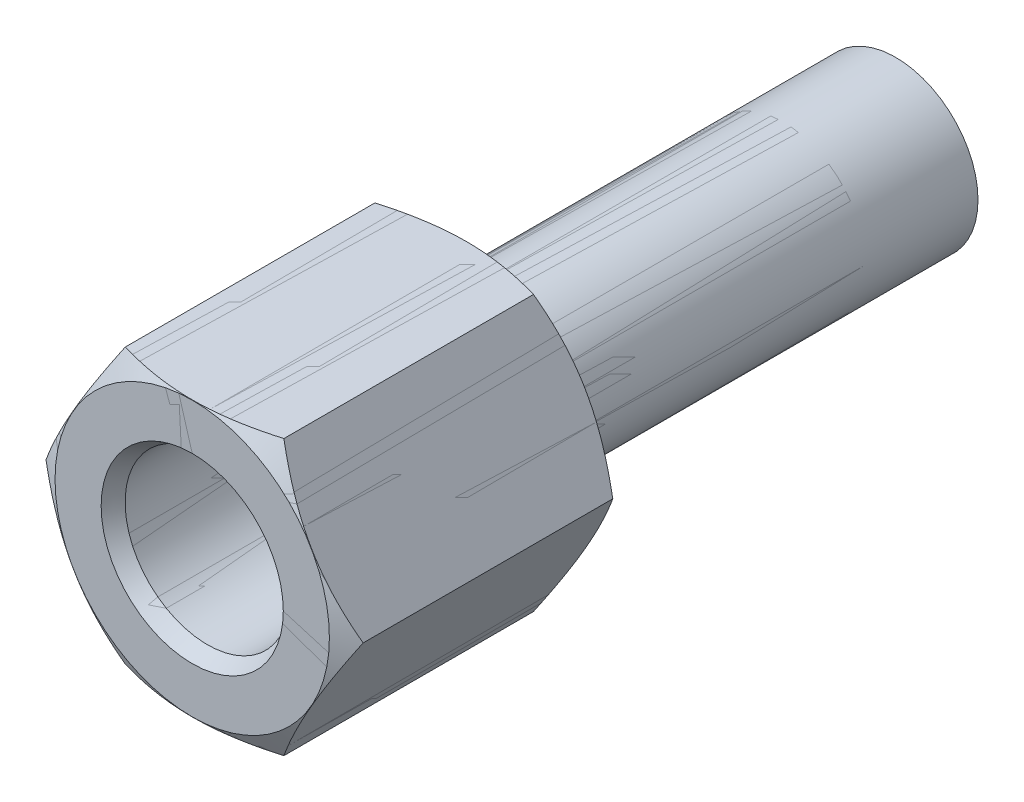
ISO-10303-21;
HEADER;
FILE_DESCRIPTION(('STEP AP214'),'2;1');
FILE_NAME('part.step','',(''),(''),'','','');
FILE_SCHEMA(('AUTOMOTIVE_DESIGN { 1 0 10303 214 1 1 1 1 }'));
ENDSEC;
DATA;
#1=APPLICATION_CONTEXT('core data for automotive mechanical design processes');
#2=APPLICATION_PROTOCOL_DEFINITION('international standard','automotive_design',2000,#1);
#3=PRODUCT_CONTEXT('',#1,'mechanical');
#4=PRODUCT('Part','Part','',(#3));
#5=PRODUCT_RELATED_PRODUCT_CATEGORY('part','',(#4));
#6=PRODUCT_DEFINITION_FORMATION('','',#4);
#7=PRODUCT_DEFINITION_CONTEXT('part definition',#1,'design');
#8=PRODUCT_DEFINITION('design','',#6,#7);
#9=PRODUCT_DEFINITION_SHAPE('','',#8);
#10=(LENGTH_UNIT() NAMED_UNIT(*) SI_UNIT(.MILLI.,.METRE.));
#11=(NAMED_UNIT(*) PLANE_ANGLE_UNIT() SI_UNIT($,.RADIAN.));
#12=(NAMED_UNIT(*) SI_UNIT($,.STERADIAN.) SOLID_ANGLE_UNIT());
#13=UNCERTAINTY_MEASURE_WITH_UNIT(LENGTH_MEASURE(1.E-05),#10,'distance_accuracy_value','');
#14=(GEOMETRIC_REPRESENTATION_CONTEXT(3) GLOBAL_UNCERTAINTY_ASSIGNED_CONTEXT((#13)) GLOBAL_UNIT_ASSIGNED_CONTEXT((#10,
#11,#12)) REPRESENTATION_CONTEXT('',''));
#15=CARTESIAN_POINT('',(0.,0.,0.));
#16=DIRECTION('',(0.,0.,1.));
#17=DIRECTION('',(1.,0.,0.));
#18=AXIS2_PLACEMENT_3D('',#15,#16,#17);
#19=CARTESIAN_POINT('',(0.,0.,2.));
#20=DIRECTION('',(0.,0.,1.));
#21=DIRECTION('',(1.,0.,0.));
#22=AXIS2_PLACEMENT_3D('',#19,#20,#21);
#23=CONICAL_SURFACE('',#22,1.5,1.047197551197);
#24=CARTESIAN_POINT('',(0.,0.,2.));
#25=DIRECTION('',(0.,0.,1.));
#26=DIRECTION('',(1.,0.,0.));
#27=AXIS2_PLACEMENT_3D('',#24,#25,#26);
#28=CIRCLE('',#27,1.5);
#29=CARTESIAN_POINT('',(1.5,0.,2.));
#30=VERTEX_POINT('',#29);
#31=EDGE_CURVE('P0_E46',#30,#30,#28,.T.);
#32=ORIENTED_EDGE('',*,*,#31,.T.);
#33=DIRECTION('',(-0.866025403784329,0.,-0.50000000000019));
#34=VECTOR('',#33,1.);
#35=CARTESIAN_POINT('',(1.5,0.,2.));
#36=LINE('',#35,#34);
#37=CARTESIAN_POINT('',(0.,0.,1.133974596216));
#38=VERTEX_POINT('',#37);
#39=EDGE_CURVE('P0_E11',#30,#38,#36,.T.);
#40=ORIENTED_EDGE('',*,*,#39,.T.);
#41=ORIENTED_EDGE('',*,*,#39,.F.);
#42=EDGE_LOOP('',(#32,#40,#41));
#43=FACE_BOUND('',#42,.T.);
#44=ADVANCED_FACE('P0_F37',(#43),#23,.F.);
#45=CARTESIAN_POINT('',(0.,0.,4.722871870789));
#46=DIRECTION('',(0.,0.,-1.));
#47=DIRECTION('',(1.,0.,0.));
#48=AXIS2_PLACEMENT_3D('',#45,#46,#47);
#49=CYLINDRICAL_SURFACE('',#48,1.5);
#50=CARTESIAN_POINT('',(0.,0.,4.722871870789));
#51=DIRECTION('',(0.,0.,1.));
#52=DIRECTION('',(1.,0.,0.));
#53=AXIS2_PLACEMENT_3D('',#50,#51,#52);
#54=CIRCLE('',#53,1.5);
#55=CARTESIAN_POINT('',(1.5,0.,4.722871870789));
#56=VERTEX_POINT('',#55);
#57=EDGE_CURVE('P0_E180',#56,#56,#54,.T.);
#58=ORIENTED_EDGE('',*,*,#57,.T.);
#59=DIRECTION('',(0.,0.,-1.));
#60=VECTOR('',#59,1.);
#61=CARTESIAN_POINT('',(1.5,0.,4.722871870789));
#62=LINE('',#61,#60);
#63=EDGE_CURVE('P0_E182',#56,#30,#62,.T.);
#64=ORIENTED_EDGE('',*,*,#63,.T.);
#65=ORIENTED_EDGE('',*,*,#31,.F.);
#66=ORIENTED_EDGE('',*,*,#63,.F.);
#67=EDGE_LOOP('',(#58,#64,#65,#66));
#68=FACE_BOUND('',#67,.T.);
#69=ADVANCED_FACE('P0_F39',(#68),#49,.F.);
#70=CARTESIAN_POINT('',(0.,0.,5.));
#71=DIRECTION('',(0.,0.,1.));
#72=DIRECTION('',(1.,0.,0.));
#73=AXIS2_PLACEMENT_3D('',#70,#71,#72);
#74=CONICAL_SURFACE('',#73,1.66,0.523598775598);
#75=CARTESIAN_POINT('',(0.,0.,5.));
#76=DIRECTION('',(0.,0.,1.));
#77=DIRECTION('',(1.,0.,0.));
#78=AXIS2_PLACEMENT_3D('',#75,#76,#77);
#79=CIRCLE('',#78,1.66);
#80=CARTESIAN_POINT('',(1.66,0.,5.));
#81=VERTEX_POINT('',#80);
#82=EDGE_CURVE('P0_E152',#81,#81,#79,.T.);
#83=ORIENTED_EDGE('',*,*,#82,.T.);
#84=DIRECTION('',(-0.50000000000019,0.,-0.866025403784329));
#85=VECTOR('',#84,1.);
#86=CARTESIAN_POINT('',(1.66,0.,5.));
#87=LINE('',#86,#85);
#88=EDGE_CURVE('P0_E151',#81,#56,#87,.T.);
#89=ORIENTED_EDGE('',*,*,#88,.T.);
#90=ORIENTED_EDGE('',*,*,#57,.F.);
#91=ORIENTED_EDGE('',*,*,#88,.F.);
#92=EDGE_LOOP('',(#83,#89,#90,#91));
#93=FACE_BOUND('',#92,.T.);
#94=ADVANCED_FACE('P0_F286',(#93),#74,.F.);
#95=CARTESIAN_POINT('',(0.,0.,-7.821021416551));
#96=DIRECTION('',(0.,0.,1.));
#97=DIRECTION('',(1.,0.,0.));
#98=AXIS2_PLACEMENT_3D('',#95,#96,#97);
#99=CYLINDRICAL_SURFACE('',#98,1.5);
#100=CARTESIAN_POINT('',(0.,0.,-5.774833395025));
#101=DIRECTION('',(0.,0.,1.));
#102=DIRECTION('',(1.,0.,0.));
#103=AXIS2_PLACEMENT_3D('',#100,#101,#102);
#104=CIRCLE('',#103,1.5);
#105=CARTESIAN_POINT('',(1.5,0.,-5.774833395025));
#106=VERTEX_POINT('',#105);
#107=EDGE_CURVE('P0_E41',#106,#106,#104,.F.);
#108=ORIENTED_EDGE('',*,*,#107,.F.);
#109=DIRECTION('',(0.,0.,1.));
#110=VECTOR('',#109,1.);
#111=CARTESIAN_POINT('',(1.5,0.,-7.821021416551));
#112=LINE('',#111,#110);
#113=CARTESIAN_POINT('',(1.5,0.,0.));
#114=VERTEX_POINT('',#113);
#115=EDGE_CURVE('P0_E146',#106,#114,#112,.T.);
#116=ORIENTED_EDGE('',*,*,#115,.T.);
#117=CARTESIAN_POINT('',(0.,0.,0.));
#118=DIRECTION('',(0.,0.,1.));
#119=DIRECTION('',(1.,0.,0.));
#120=AXIS2_PLACEMENT_3D('',#117,#118,#119);
#121=CIRCLE('',#120,1.5);
#122=EDGE_CURVE('P0_E120',#114,#114,#121,.T.);
#123=ORIENTED_EDGE('',*,*,#122,.F.);
#124=ORIENTED_EDGE('',*,*,#115,.F.);
#125=EDGE_LOOP('',(#108,#116,#123,#124));
#126=FACE_BOUND('',#125,.T.);
#127=ADVANCED_FACE('P0_F277',(#126),#99,.T.);
#128=CARTESIAN_POINT('',(0.,0.,5.));
#129=DIRECTION('',(0.,0.,1.));
#130=DIRECTION('',(1.,0.,0.));
#131=AXIS2_PLACEMENT_3D('',#128,#129,#130);
#132=PLANE('',#131);
#133=ORIENTED_EDGE('',*,*,#82,.F.);
#134=EDGE_LOOP('',(#133));
#135=FACE_BOUND('',#134,.T.);
#136=CARTESIAN_POINT('',(0.,0.,5.));
#137=DIRECTION('',(0.,0.,1.));
#138=DIRECTION('',(1.,0.,0.));
#139=AXIS2_PLACEMENT_3D('',#136,#137,#138);
#140=CIRCLE('',#139,2.5);
#141=CARTESIAN_POINT('',(2.5,0.,5.));
#142=VERTEX_POINT('',#141);
#143=EDGE_CURVE('P0_E199',#142,#142,#140,.T.);
#144=ORIENTED_EDGE('',*,*,#143,.T.);
#145=EDGE_LOOP('',(#144));
#146=FACE_BOUND('',#145,.T.);
#147=ADVANCED_FACE('P0_F274',(#135,#146),#132,.T.);
#148=CARTESIAN_POINT('',(0.,0.,0.));
#149=DIRECTION('',(0.,0.,1.));
#150=DIRECTION('',(1.,0.,0.));
#151=AXIS2_PLACEMENT_3D('',#148,#149,#150);
#152=PLANE('',#151);
#153=CARTESIAN_POINT('',(0.,0.,0.));
#154=DIRECTION('',(0.,0.,1.));
#155=DIRECTION('',(1.,0.,0.));
#156=AXIS2_PLACEMENT_3D('',#153,#154,#155);
#157=CIRCLE('',#156,2.5);
#158=CARTESIAN_POINT('',(2.5,0.,0.));
#159=VERTEX_POINT('',#158);
#160=EDGE_CURVE('P0_E136',#159,#159,#157,.T.);
#161=ORIENTED_EDGE('',*,*,#160,.F.);
#162=EDGE_LOOP('',(#161));
#163=FACE_BOUND('',#162,.T.);
#164=ORIENTED_EDGE('',*,*,#122,.T.);
#165=EDGE_LOOP('',(#164));
#166=FACE_BOUND('',#165,.T.);
#167=ADVANCED_FACE('P0_F276',(#163,#166),#152,.F.);
#168=CARTESIAN_POINT('',(-1.445,-2.502813416937,-10.));
#169=DIRECTION('',(0.,1.,0.));
#170=DIRECTION('',(1.,0.,0.));
#171=AXIS2_PLACEMENT_3D('',#168,#169,#170);
#172=PLANE('',#171);
#173=DIRECTION('',(0.,0.,1.));
#174=VECTOR('',#173,1.);
#175=CARTESIAN_POINT('',(1.445,-2.502813416937,-10.));
#176=LINE('',#175,#174);
#177=CARTESIAN_POINT('',(1.445,-2.502813416937,0.225166604975));
#178=VERTEX_POINT('',#177);
#179=CARTESIAN_POINT('',(1.445,-2.502813416937,4.774833395016));
#180=VERTEX_POINT('',#179);
#181=EDGE_CURVE('P0_E192',#178,#180,#176,.T.);
#182=ORIENTED_EDGE('',*,*,#181,.T.);
#183=CARTESIAN_POINT('',(1.44500000000008,-2.502813416937,4.77483339501595));
#184=CARTESIAN_POINT('',(0.,-2.50281341693702,5.1919689645055));
#185=CARTESIAN_POINT('',(-1.44499999999997,-2.502813416937,4.77483339501598));
#186=(BOUNDED_CURVE() B_SPLINE_CURVE(2,(#183,#184,#185),.UNSPECIFIED.,.F.,
.F.) B_SPLINE_CURVE_WITH_KNOTS((3,3),(0.,1.),
.UNSPECIFIED.) CURVE() GEOMETRIC_REPRESENTATION_ITEM() RATIONAL_B_SPLINE_CURVE((1.,
1.15470053837926,1.)) REPRESENTATION_ITEM(''));
#187=CARTESIAN_POINT('',(-1.445,-2.502813416937,4.774833395016));
#188=VERTEX_POINT('',#187);
#189=EDGE_CURVE('P0_E116',#180,#188,#186,.T.);
#190=ORIENTED_EDGE('',*,*,#189,.T.);
#191=DIRECTION('',(0.,0.,1.));
#192=VECTOR('',#191,1.);
#193=CARTESIAN_POINT('',(-1.445,-2.502813416937,-10.));
#194=LINE('',#193,#192);
#195=CARTESIAN_POINT('',(-1.445,-2.502813416937,0.225166604975));
#196=VERTEX_POINT('',#195);
#197=EDGE_CURVE('P0_E109',#196,#188,#194,.T.);
#198=ORIENTED_EDGE('',*,*,#197,.F.);
#199=CARTESIAN_POINT('',(-1.44500000000178,-2.502813416937,0.225166604976029));
#200=CARTESIAN_POINT('',(-8.90842954959227E-13,-2.502813416937,-0.19196896449825));
#201=CARTESIAN_POINT('',(1.44499999999941,-2.502813416937,0.225166604975343));
#202=(BOUNDED_CURVE() B_SPLINE_CURVE(2,(#199,#200,#201),.UNSPECIFIED.,.F.,
.F.) B_SPLINE_CURVE_WITH_KNOTS((3,3),(0.,1.),
.UNSPECIFIED.) CURVE() GEOMETRIC_REPRESENTATION_ITEM() RATIONAL_B_SPLINE_CURVE((1.,
1.15470053837937,1.)) REPRESENTATION_ITEM(''));
#203=EDGE_CURVE('P0_E113',#196,#178,#202,.T.);
#204=ORIENTED_EDGE('',*,*,#203,.T.);
#205=EDGE_LOOP('',(#182,#190,#198,#204));
#206=FACE_BOUND('',#205,.T.);
#207=ADVANCED_FACE('P0_F111',(#206),#172,.F.);
#208=CARTESIAN_POINT('',(-2.89,0.,-10.));
#209=DIRECTION('',(0.866025403784329,0.50000000000019,0.));
#210=DIRECTION('',(0.,0.,-1.));
#211=AXIS2_PLACEMENT_3D('',#208,#209,#210);
#212=PLANE('',#211);
#213=ORIENTED_EDGE('',*,*,#197,.T.);
#214=CARTESIAN_POINT('',(-1.44499999999986,-2.50281341693713,4.77483339501589));
#215=CARTESIAN_POINT('',(-2.16750000000006,-1.25140670846891,5.19196896450558));
#216=CARTESIAN_POINT('',(-2.89000000000029,-6.22391027604863E-13,4.77483339501581));
#217=(BOUNDED_CURVE() B_SPLINE_CURVE(2,(#214,#215,#216),.UNSPECIFIED.,.F.,
.F.) B_SPLINE_CURVE_WITH_KNOTS((3,3),(0.,1.),
.UNSPECIFIED.) CURVE() GEOMETRIC_REPRESENTATION_ITEM() RATIONAL_B_SPLINE_CURVE((1.,
1.15470053837934,1.)) REPRESENTATION_ITEM(''));
#218=CARTESIAN_POINT('',(-2.89,0.,4.774833395016));
#219=VERTEX_POINT('',#218);
#220=EDGE_CURVE('P0_E211',#188,#219,#217,.T.);
#221=ORIENTED_EDGE('',*,*,#220,.T.);
#222=DIRECTION('',(0.,0.,1.));
#223=VECTOR('',#222,1.);
#224=CARTESIAN_POINT('',(-2.89,0.,-10.));
#225=LINE('',#224,#223);
#226=CARTESIAN_POINT('',(-2.89,0.,0.225166604975));
#227=VERTEX_POINT('',#226);
#228=EDGE_CURVE('P0_E121',#227,#219,#225,.T.);
#229=ORIENTED_EDGE('',*,*,#228,.F.);
#230=CARTESIAN_POINT('',(-2.89000000000179,1.98396854500515E-12,0.22516660497655));
#231=CARTESIAN_POINT('',(-2.16750000000077,-1.25140670846767,-0.191968964498452));
#232=CARTESIAN_POINT('',(-1.44500000000026,-2.50281341693643,0.225166604975364));
#233=(BOUNDED_CURVE() B_SPLINE_CURVE(2,(#230,#231,#232),.UNSPECIFIED.,.F.,
.F.) B_SPLINE_CURVE_WITH_KNOTS((3,3),(0.,1.),
.UNSPECIFIED.) CURVE() GEOMETRIC_REPRESENTATION_ITEM() RATIONAL_B_SPLINE_CURVE((1.,
1.15470053837956,1.)) REPRESENTATION_ITEM(''));
#234=EDGE_CURVE('P0_E124',#227,#196,#233,.T.);
#235=ORIENTED_EDGE('',*,*,#234,.T.);
#236=EDGE_LOOP('',(#213,#221,#229,#235));
#237=FACE_BOUND('',#236,.T.);
#238=ADVANCED_FACE('P0_F125',(#237),#212,.F.);
#239=CARTESIAN_POINT('',(-1.445,2.502813416937,-10.));
#240=DIRECTION('',(0.866025403784329,-0.50000000000019,0.));
#241=DIRECTION('',(0.,0.,-1.));
#242=AXIS2_PLACEMENT_3D('',#239,#240,#241);
#243=PLANE('',#242);
#244=ORIENTED_EDGE('',*,*,#228,.T.);
#245=CARTESIAN_POINT('',(-2.89000000000108,-7.4718009557273E-13,4.77483339501536));
#246=CARTESIAN_POINT('',(-2.1675000000004,1.25140670846831,5.19196896450573));
#247=CARTESIAN_POINT('',(-1.44499999999998,2.50281341693692,4.77483339501596));
#248=(BOUNDED_CURVE() B_SPLINE_CURVE(2,(#245,#246,#247),.UNSPECIFIED.,.F.,
.F.) B_SPLINE_CURVE_WITH_KNOTS((3,3),(0.,1.),
.UNSPECIFIED.) CURVE() GEOMETRIC_REPRESENTATION_ITEM() RATIONAL_B_SPLINE_CURVE((1.,
1.15470053837947,1.)) REPRESENTATION_ITEM(''));
#249=CARTESIAN_POINT('',(-1.445,2.502813416937,4.774833395016));
#250=VERTEX_POINT('',#249);
#251=EDGE_CURVE('P0_E207',#219,#250,#248,.T.);
#252=ORIENTED_EDGE('',*,*,#251,.T.);
#253=DIRECTION('',(0.,0.,1.));
#254=VECTOR('',#253,1.);
#255=CARTESIAN_POINT('',(-1.445,2.502813416937,-10.));
#256=LINE('',#255,#254);
#257=CARTESIAN_POINT('',(-1.445,2.502813416937,0.225166604975));
#258=VERTEX_POINT('',#257);
#259=EDGE_CURVE('P0_E157',#258,#250,#256,.T.);
#260=ORIENTED_EDGE('',*,*,#259,.F.);
#261=CARTESIAN_POINT('',(-1.444999999999,2.50281341693861,0.22516660497609));
#262=CARTESIAN_POINT('',(-2.16749999999965,1.25140670846962,-0.191968964498347));
#263=CARTESIAN_POINT('',(-2.89000000000005,1.03450581434572E-12,0.225166604975544));
#264=(BOUNDED_CURVE() B_SPLINE_CURVE(2,(#261,#262,#263),.UNSPECIFIED.,.F.,
.F.) B_SPLINE_CURVE_WITH_KNOTS((3,3),(0.,1.),
.UNSPECIFIED.) CURVE() GEOMETRIC_REPRESENTATION_ITEM() RATIONAL_B_SPLINE_CURVE((1.,
1.15470053837947,1.)) REPRESENTATION_ITEM(''));
#265=EDGE_CURVE('P0_E129',#258,#227,#264,.T.);
#266=ORIENTED_EDGE('',*,*,#265,.T.);
#267=EDGE_LOOP('',(#244,#252,#260,#266));
#268=FACE_BOUND('',#267,.T.);
#269=ADVANCED_FACE('P0_F254',(#268),#243,.F.);
#270=CARTESIAN_POINT('',(1.445,-2.502813416937,-10.));
#271=DIRECTION('',(-0.866025403784329,0.50000000000019,0.));
#272=DIRECTION('',(0.,0.,1.));
#273=AXIS2_PLACEMENT_3D('',#270,#271,#272);
#274=PLANE('',#273);
#275=DIRECTION('',(0.,0.,1.));
#276=VECTOR('',#275,1.);
#277=CARTESIAN_POINT('',(2.89,0.,0.225166604975));
#278=LINE('',#277,#276);
#279=CARTESIAN_POINT('',(2.89,0.,0.225166604975));
#280=VERTEX_POINT('',#279);
#281=CARTESIAN_POINT('',(2.89,0.,4.774833395016));
#282=VERTEX_POINT('',#281);
#283=EDGE_CURVE('P0_E170',#280,#282,#278,.T.);
#284=ORIENTED_EDGE('',*,*,#283,.T.);
#285=CARTESIAN_POINT('',(2.89000000000101,6.29496454962464E-13,4.77483339501539));
#286=CARTESIAN_POINT('',(2.16750000000037,-1.25140670846836,5.19196896450572));
#287=CARTESIAN_POINT('',(1.44499999999998,-2.50281341693692,4.77483339501596));
#288=(BOUNDED_CURVE() B_SPLINE_CURVE(2,(#285,#286,#287),.UNSPECIFIED.,.F.,
.F.) B_SPLINE_CURVE_WITH_KNOTS((3,3),(0.,1.),
.UNSPECIFIED.) CURVE() GEOMETRIC_REPRESENTATION_ITEM() RATIONAL_B_SPLINE_CURVE((1.,
1.15470053837946,1.)) REPRESENTATION_ITEM(''));
#289=EDGE_CURVE('P0_E142',#282,#180,#288,.T.);
#290=ORIENTED_EDGE('',*,*,#289,.T.);
#291=ORIENTED_EDGE('',*,*,#181,.F.);
#292=CARTESIAN_POINT('',(1.444999999999,-2.50281341693861,0.22516660497609));
#293=CARTESIAN_POINT('',(2.16749999999964,-1.25140670846963,-0.191968964498342));
#294=CARTESIAN_POINT('',(2.89,-1.07447384323223E-12,0.22516660497553));
#295=(BOUNDED_CURVE() B_SPLINE_CURVE(2,(#292,#293,#294),.UNSPECIFIED.,.F.,
.F.) B_SPLINE_CURVE_WITH_KNOTS((3,3),(0.,1.),
.UNSPECIFIED.) CURVE() GEOMETRIC_REPRESENTATION_ITEM() RATIONAL_B_SPLINE_CURVE((1.,
1.15470053837946,1.)) REPRESENTATION_ITEM(''));
#296=EDGE_CURVE('P0_E134',#178,#280,#295,.T.);
#297=ORIENTED_EDGE('',*,*,#296,.T.);
#298=EDGE_LOOP('',(#284,#290,#291,#297));
#299=FACE_BOUND('',#298,.T.);
#300=ADVANCED_FACE('P0_F271',(#299),#274,.F.);
#301=CARTESIAN_POINT('',(0.,0.,4.774833395016));
#302=DIRECTION('',(0.,0.,-1.));
#303=DIRECTION('',(1.,0.,0.));
#304=AXIS2_PLACEMENT_3D('',#301,#302,#303);
#305=CONICAL_SURFACE('',#304,2.89,1.047197551197);
#306=ORIENTED_EDGE('',*,*,#289,.F.);
#307=DIRECTION('',(-0.866025403784329,0.,0.50000000000019));
#308=VECTOR('',#307,1.);
#309=CARTESIAN_POINT('',(2.89,0.,4.774833395016));
#310=LINE('',#309,#308);
#311=EDGE_CURVE('P0_E196',#282,#142,#310,.T.);
#312=ORIENTED_EDGE('',*,*,#311,.T.);
#313=ORIENTED_EDGE('',*,*,#143,.F.);
#314=ORIENTED_EDGE('',*,*,#311,.F.);
#315=CARTESIAN_POINT('',(1.44499999999986,2.50281341693713,4.77483339501589));
#316=CARTESIAN_POINT('',(2.16750000000006,1.25140670846889,5.19196896450558));
#317=CARTESIAN_POINT('',(2.89000000000031,5.83311177138057E-13,4.7748333950158));
#318=(BOUNDED_CURVE() B_SPLINE_CURVE(2,(#315,#316,#317),.UNSPECIFIED.,.F.,
.F.) B_SPLINE_CURVE_WITH_KNOTS((3,3),(0.,1.),
.UNSPECIFIED.) CURVE() GEOMETRIC_REPRESENTATION_ITEM() RATIONAL_B_SPLINE_CURVE((1.,
1.15470053837934,1.)) REPRESENTATION_ITEM(''));
#319=CARTESIAN_POINT('',(1.445,2.502813416937,4.774833395016));
#320=VERTEX_POINT('',#319);
#321=EDGE_CURVE('P0_E177',#320,#282,#318,.T.);
#322=ORIENTED_EDGE('',*,*,#321,.F.);
#323=CARTESIAN_POINT('',(-1.44500000000008,2.502813416937,4.77483339501595));
#324=CARTESIAN_POINT('',(0.,2.50281341693702,5.1919689645055));
#325=CARTESIAN_POINT('',(1.44499999999997,2.502813416937,4.77483339501598));
#326=(BOUNDED_CURVE() B_SPLINE_CURVE(2,(#323,#324,#325),.UNSPECIFIED.,.F.,
.F.) B_SPLINE_CURVE_WITH_KNOTS((3,3),(0.,1.),
.UNSPECIFIED.) CURVE() GEOMETRIC_REPRESENTATION_ITEM() RATIONAL_B_SPLINE_CURVE((1.,
1.15470053837926,1.)) REPRESENTATION_ITEM(''));
#327=EDGE_CURVE('P0_E163',#250,#320,#326,.T.);
#328=ORIENTED_EDGE('',*,*,#327,.F.);
#329=ORIENTED_EDGE('',*,*,#251,.F.);
#330=ORIENTED_EDGE('',*,*,#220,.F.);
#331=ORIENTED_EDGE('',*,*,#189,.F.);
#332=EDGE_LOOP('',(#306,#312,#313,#314,#322,#328,#329,#330,#331));
#333=FACE_BOUND('',#332,.T.);
#334=ADVANCED_FACE('P0_F259',(#333),#305,.T.);
#335=CARTESIAN_POINT('',(1.445,2.502813416937,-10.));
#336=DIRECTION('',(0.,-1.,0.));
#337=DIRECTION('',(-1.,0.,0.));
#338=AXIS2_PLACEMENT_3D('',#335,#336,#337);
#339=PLANE('',#338);
#340=ORIENTED_EDGE('',*,*,#259,.T.);
#341=ORIENTED_EDGE('',*,*,#327,.T.);
#342=DIRECTION('',(0.,0.,1.));
#343=VECTOR('',#342,1.);
#344=CARTESIAN_POINT('',(1.445,2.502813416937,-10.));
#345=LINE('',#344,#343);
#346=CARTESIAN_POINT('',(1.445,2.502813416937,0.225166604975));
#347=VERTEX_POINT('',#346);
#348=EDGE_CURVE('P0_E171',#347,#320,#345,.T.);
#349=ORIENTED_EDGE('',*,*,#348,.F.);
#350=CARTESIAN_POINT('',(1.44500000000178,2.502813416937,0.225166604976029));
#351=CARTESIAN_POINT('',(8.90398865749375E-13,2.50281341693701,-0.19196896449825));
#352=CARTESIAN_POINT('',(-1.44499999999941,2.502813416937,0.225166604975343));
#353=(BOUNDED_CURVE() B_SPLINE_CURVE(2,(#350,#351,#352),.UNSPECIFIED.,.F.,
.F.) B_SPLINE_CURVE_WITH_KNOTS((3,3),(0.,1.),
.UNSPECIFIED.) CURVE() GEOMETRIC_REPRESENTATION_ITEM() RATIONAL_B_SPLINE_CURVE((1.,
1.15470053837937,1.)) REPRESENTATION_ITEM(''));
#354=EDGE_CURVE('P0_E156',#347,#258,#353,.T.);
#355=ORIENTED_EDGE('',*,*,#354,.T.);
#356=EDGE_LOOP('',(#340,#341,#349,#355));
#357=FACE_BOUND('',#356,.T.);
#358=ADVANCED_FACE('P0_F264',(#357),#339,.F.);
#359=CARTESIAN_POINT('',(0.,0.,0.));
#360=DIRECTION('',(0.,0.,1.));
#361=DIRECTION('',(1.,0.,0.));
#362=AXIS2_PLACEMENT_3D('',#359,#360,#361);
#363=CONICAL_SURFACE('',#362,2.5,1.047197551213);
#364=DIRECTION('',(0.866025403792641,0.,0.499999999985793));
#365=VECTOR('',#364,1.);
#366=CARTESIAN_POINT('',(2.5,0.,0.));
#367=LINE('',#366,#365);
#368=EDGE_CURVE('P0_E169',#159,#280,#367,.T.);
#369=ORIENTED_EDGE('',*,*,#368,.F.);
#370=ORIENTED_EDGE('',*,*,#160,.T.);
#371=ORIENTED_EDGE('',*,*,#368,.T.);
#372=ORIENTED_EDGE('',*,*,#296,.F.);
#373=ORIENTED_EDGE('',*,*,#203,.F.);
#374=ORIENTED_EDGE('',*,*,#234,.F.);
#375=ORIENTED_EDGE('',*,*,#265,.F.);
#376=ORIENTED_EDGE('',*,*,#354,.F.);
#377=CARTESIAN_POINT('',(2.89000000000186,-2.10342854245482E-12,0.225166604976589));
#378=CARTESIAN_POINT('',(2.1675000000008,1.25140670846762,-0.191968964498467));
#379=CARTESIAN_POINT('',(1.44500000000026,2.50281341693643,0.225166604975364));
#380=(BOUNDED_CURVE() B_SPLINE_CURVE(2,(#377,#378,#379),.UNSPECIFIED.,.F.,
.F.) B_SPLINE_CURVE_WITH_KNOTS((3,3),(0.,1.),
.UNSPECIFIED.) CURVE() GEOMETRIC_REPRESENTATION_ITEM() RATIONAL_B_SPLINE_CURVE((1.,
1.15470053837958,1.)) REPRESENTATION_ITEM(''));
#381=EDGE_CURVE('P0_E164',#280,#347,#380,.T.);
#382=ORIENTED_EDGE('',*,*,#381,.F.);
#383=EDGE_LOOP('',(#369,#370,#371,#372,#373,#374,#375,#376,#382));
#384=FACE_BOUND('',#383,.T.);
#385=ADVANCED_FACE('P0_F132',(#384),#363,.T.);
#386=CARTESIAN_POINT('',(2.89,0.,-10.));
#387=DIRECTION('',(-0.866025403784329,-0.50000000000019,0.));
#388=DIRECTION('',(-0.50000000000019,0.866025403784329,0.));
#389=AXIS2_PLACEMENT_3D('',#386,#387,#388);
#390=PLANE('',#389);
#391=ORIENTED_EDGE('',*,*,#348,.T.);
#392=ORIENTED_EDGE('',*,*,#321,.T.);
#393=ORIENTED_EDGE('',*,*,#283,.F.);
#394=ORIENTED_EDGE('',*,*,#381,.T.);
#395=EDGE_LOOP('',(#391,#392,#393,#394));
#396=FACE_BOUND('',#395,.T.);
#397=ADVANCED_FACE('P0_F268',(#396),#390,.F.);
#398=CARTESIAN_POINT('',(0.,-2.50281341693861,-5.774833395025));
#399=DIRECTION('',(0.,0.,1.));
#400=DIRECTION('',(1.,0.,0.));
#401=AXIS2_PLACEMENT_3D('',#398,#399,#400);
#402=PLANE('',#401);
#403=ORIENTED_EDGE('',*,*,#107,.T.);
#404=EDGE_LOOP('',(#403));
#405=FACE_BOUND('',#404,.T.);
#406=ADVANCED_FACE('P0_F304',(#405),#402,.F.);
#407=CLOSED_SHELL('',(#44,#69,#94,#127,#147,#167,#207,#238,#269,#300,#334,#358,#385,#397,#406));
#408=MANIFOLD_SOLID_BREP('P0_B2',#407);
#409=CARTESIAN_POINT('',(0.,0.,2.));
#410=DIRECTION('',(0.,0.,1.));
#411=DIRECTION('',(1.,0.,0.));
#412=AXIS2_PLACEMENT_3D('',#409,#410,#411);
#413=CONICAL_SURFACE('',#412,1.5,1.047197551197);
#414=CARTESIAN_POINT('',(0.,0.,2.));
#415=DIRECTION('',(0.,0.,1.));
#416=DIRECTION('',(1.,0.,0.));
#417=AXIS2_PLACEMENT_3D('',#414,#415,#416);
#418=CIRCLE('',#417,1.5);
#419=CARTESIAN_POINT('',(1.5,0.,2.));
#420=VERTEX_POINT('',#419);
#421=EDGE_CURVE('P1_E27',#420,#420,#418,.T.);
#422=ORIENTED_EDGE('',*,*,#421,.T.);
#423=DIRECTION('',(-0.866025403784329,0.,-0.50000000000019));
#424=VECTOR('',#423,1.);
#425=CARTESIAN_POINT('',(1.5,0.,2.));
#426=LINE('',#425,#424);
#427=CARTESIAN_POINT('',(0.,0.,1.133974596216));
#428=VERTEX_POINT('',#427);
#429=EDGE_CURVE('P1_E11',#420,#428,#426,.T.);
#430=ORIENTED_EDGE('',*,*,#429,.T.);
#431=ORIENTED_EDGE('',*,*,#429,.F.);
#432=EDGE_LOOP('',(#422,#430,#431));
#433=FACE_BOUND('',#432,.T.);
#434=ADVANCED_FACE('P1_F16',(#433),#413,.F.);
#435=CARTESIAN_POINT('',(0.,0.,-8.));
#436=DIRECTION('',(0.,0.,1.));
#437=DIRECTION('',(1.,0.,0.));
#438=AXIS2_PLACEMENT_3D('',#435,#436,#437);
#439=PLANE('',#438);
#440=CARTESIAN_POINT('',(0.,0.,-8.));
#441=DIRECTION('',(0.,0.,1.));
#442=DIRECTION('',(1.,0.,0.));
#443=AXIS2_PLACEMENT_3D('',#440,#441,#442);
#444=CIRCLE('',#443,1.19);
#445=CARTESIAN_POINT('',(1.19,0.,-8.));
#446=VERTEX_POINT('',#445);
#447=EDGE_CURVE('P1_E20',#446,#446,#444,.T.);
#448=ORIENTED_EDGE('',*,*,#447,.F.);
#449=EDGE_LOOP('',(#448));
#450=FACE_BOUND('',#449,.T.);
#451=ADVANCED_FACE('P1_F350',(#450),#439,.F.);
#452=CARTESIAN_POINT('',(0.,0.,4.722871870789));
#453=DIRECTION('',(0.,0.,-1.));
#454=DIRECTION('',(1.,0.,0.));
#455=AXIS2_PLACEMENT_3D('',#452,#453,#454);
#456=CYLINDRICAL_SURFACE('',#455,1.5);
#457=CARTESIAN_POINT('',(0.,0.,4.722871870789));
#458=DIRECTION('',(0.,0.,1.));
#459=DIRECTION('',(1.,0.,0.));
#460=AXIS2_PLACEMENT_3D('',#457,#458,#459);
#461=CIRCLE('',#460,1.5);
#462=CARTESIAN_POINT('',(1.5,0.,4.722871870789));
#463=VERTEX_POINT('',#462);
#464=EDGE_CURVE('P1_E125',#463,#463,#461,.T.);
#465=ORIENTED_EDGE('',*,*,#464,.T.);
#466=DIRECTION('',(0.,0.,-1.));
#467=VECTOR('',#466,1.);
#468=CARTESIAN_POINT('',(1.5,0.,4.722871870789));
#469=LINE('',#468,#467);
#470=EDGE_CURVE('P1_E116',#463,#420,#469,.T.);
#471=ORIENTED_EDGE('',*,*,#470,.T.);
#472=ORIENTED_EDGE('',*,*,#421,.F.);
#473=ORIENTED_EDGE('',*,*,#470,.F.);
#474=EDGE_LOOP('',(#465,#471,#472,#473));
#475=FACE_BOUND('',#474,.T.);
#476=ADVANCED_FACE('P1_F18',(#475),#456,.F.);
#477=CARTESIAN_POINT('',(0.,0.,-8.));
#478=DIRECTION('',(0.,0.,1.));
#479=DIRECTION('',(1.,0.,0.));
#480=AXIS2_PLACEMENT_3D('',#477,#478,#479);
#481=CONICAL_SURFACE('',#480,1.19,1.047197551197);
#482=ORIENTED_EDGE('',*,*,#447,.T.);
#483=DIRECTION('',(0.866025403784329,0.,0.50000000000019));
#484=VECTOR('',#483,1.);
#485=CARTESIAN_POINT('',(1.19,0.,-8.));
#486=LINE('',#485,#484);
#487=CARTESIAN_POINT('',(1.5,0.,-7.821021416551));
#488=VERTEX_POINT('',#487);
#489=EDGE_CURVE('P1_E109',#446,#488,#486,.T.);
#490=ORIENTED_EDGE('',*,*,#489,.T.);
#491=CARTESIAN_POINT('',(0.,0.,-7.821021416551));
#492=DIRECTION('',(0.,0.,1.));
#493=DIRECTION('',(1.,0.,0.));
#494=AXIS2_PLACEMENT_3D('',#491,#492,#493);
#495=CIRCLE('',#494,1.5);
#496=EDGE_CURVE('P1_E113',#488,#488,#495,.T.);
#497=ORIENTED_EDGE('',*,*,#496,.F.);
#498=ORIENTED_EDGE('',*,*,#489,.F.);
#499=EDGE_LOOP('',(#482,#490,#497,#498));
#500=FACE_BOUND('',#499,.T.);
#501=ADVANCED_FACE('P1_F110',(#500),#481,.T.);
#502=CARTESIAN_POINT('',(0.,0.,5.));
#503=DIRECTION('',(0.,0.,1.));
#504=DIRECTION('',(1.,0.,0.));
#505=AXIS2_PLACEMENT_3D('',#502,#503,#504);
#506=CONICAL_SURFACE('',#505,1.66,0.523598775598);
#507=CARTESIAN_POINT('',(0.,0.,5.));
#508=DIRECTION('',(0.,0.,1.));
#509=DIRECTION('',(1.,0.,0.));
#510=AXIS2_PLACEMENT_3D('',#507,#508,#509);
#511=CIRCLE('',#510,1.66);
#512=CARTESIAN_POINT('',(1.66,0.,5.));
#513=VERTEX_POINT('',#512);
#514=EDGE_CURVE('P1_E193',#513,#513,#511,.T.);
#515=ORIENTED_EDGE('',*,*,#514,.T.);
#516=DIRECTION('',(-0.50000000000019,0.,-0.866025403784329));
#517=VECTOR('',#516,1.);
#518=CARTESIAN_POINT('',(1.66,0.,5.));
#519=LINE('',#518,#517);
#520=EDGE_CURVE('P1_E145',#513,#463,#519,.T.);
#521=ORIENTED_EDGE('',*,*,#520,.T.);
#522=ORIENTED_EDGE('',*,*,#464,.F.);
#523=ORIENTED_EDGE('',*,*,#520,.F.);
#524=EDGE_LOOP('',(#515,#521,#522,#523));
#525=FACE_BOUND('',#524,.T.);
#526=ADVANCED_FACE('P1_F223',(#525),#506,.F.);
#527=CARTESIAN_POINT('',(0.,0.,-7.821021416551));
#528=DIRECTION('',(0.,0.,1.));
#529=DIRECTION('',(1.,0.,0.));
#530=AXIS2_PLACEMENT_3D('',#527,#528,#529);
#531=CYLINDRICAL_SURFACE('',#530,1.5);
#532=ORIENTED_EDGE('',*,*,#496,.T.);
#533=DIRECTION('',(0.,0.,1.));
#534=VECTOR('',#533,1.);
#535=CARTESIAN_POINT('',(1.5,0.,-7.821021416551));
#536=LINE('',#535,#534);
#537=CARTESIAN_POINT('',(1.5,0.,0.));
#538=VERTEX_POINT('',#537);
#539=EDGE_CURVE('P1_E139',#488,#538,#536,.T.);
#540=ORIENTED_EDGE('',*,*,#539,.T.);
#541=CARTESIAN_POINT('',(0.,0.,0.));
#542=DIRECTION('',(0.,0.,1.));
#543=DIRECTION('',(1.,0.,0.));
#544=AXIS2_PLACEMENT_3D('',#541,#542,#543);
#545=CIRCLE('',#544,1.5);
#546=EDGE_CURVE('P1_E184',#538,#538,#545,.T.);
#547=ORIENTED_EDGE('',*,*,#546,.F.);
#548=ORIENTED_EDGE('',*,*,#539,.F.);
#549=EDGE_LOOP('',(#532,#540,#547,#548));
#550=FACE_BOUND('',#549,.T.);
#551=ADVANCED_FACE('P1_F230',(#550),#531,.T.);
#552=CARTESIAN_POINT('',(0.,0.,5.));
#553=DIRECTION('',(0.,0.,1.));
#554=DIRECTION('',(1.,0.,0.));
#555=AXIS2_PLACEMENT_3D('',#552,#553,#554);
#556=PLANE('',#555);
#557=ORIENTED_EDGE('',*,*,#514,.F.);
#558=EDGE_LOOP('',(#557));
#559=FACE_BOUND('',#558,.T.);
#560=CARTESIAN_POINT('',(0.,0.,5.));
#561=DIRECTION('',(0.,0.,1.));
#562=DIRECTION('',(1.,0.,0.));
#563=AXIS2_PLACEMENT_3D('',#560,#561,#562);
#564=CIRCLE('',#563,2.5);
#565=CARTESIAN_POINT('',(2.5,0.,5.));
#566=VERTEX_POINT('',#565);
#567=EDGE_CURVE('P1_E214',#566,#566,#564,.T.);
#568=ORIENTED_EDGE('',*,*,#567,.T.);
#569=EDGE_LOOP('',(#568));
#570=FACE_BOUND('',#569,.T.);
#571=ADVANCED_FACE('P1_F226',(#559,#570),#556,.T.);
#572=CARTESIAN_POINT('',(0.,0.,0.));
#573=DIRECTION('',(0.,0.,1.));
#574=DIRECTION('',(1.,0.,0.));
#575=AXIS2_PLACEMENT_3D('',#572,#573,#574);
#576=PLANE('',#575);
#577=CARTESIAN_POINT('',(0.,0.,0.));
#578=DIRECTION('',(0.,0.,1.));
#579=DIRECTION('',(1.,0.,0.));
#580=AXIS2_PLACEMENT_3D('',#577,#578,#579);
#581=CIRCLE('',#580,2.5);
#582=CARTESIAN_POINT('',(2.5,0.,0.));
#583=VERTEX_POINT('',#582);
#584=EDGE_CURVE('P1_E177',#583,#583,#581,.T.);
#585=ORIENTED_EDGE('',*,*,#584,.F.);
#586=EDGE_LOOP('',(#585));
#587=FACE_BOUND('',#586,.T.);
#588=ORIENTED_EDGE('',*,*,#546,.T.);
#589=EDGE_LOOP('',(#588));
#590=FACE_BOUND('',#589,.T.);
#591=ADVANCED_FACE('P1_F229',(#587,#590),#576,.F.);
#592=CARTESIAN_POINT('',(-1.445,-2.502813416937,-10.));
#593=DIRECTION('',(0.,1.,0.));
#594=DIRECTION('',(1.,0.,0.));
#595=AXIS2_PLACEMENT_3D('',#592,#593,#594);
#596=PLANE('',#595);
#597=DIRECTION('',(0.,0.,1.));
#598=VECTOR('',#597,1.);
#599=CARTESIAN_POINT('',(1.445,-2.502813416937,-10.));
#600=LINE('',#599,#598);
#601=CARTESIAN_POINT('',(1.445,-2.502813416937,0.225166604975));
#602=VERTEX_POINT('',#601);
#603=CARTESIAN_POINT('',(1.445,-2.502813416937,4.774833395016));
#604=VERTEX_POINT('',#603);
#605=EDGE_CURVE('P1_E203',#602,#604,#600,.T.);
#606=ORIENTED_EDGE('',*,*,#605,.T.);
#607=CARTESIAN_POINT('',(1.44500000000008,-2.502813416937,4.77483339501595));
#608=CARTESIAN_POINT('',(0.,-2.50281341693702,5.1919689645055));
#609=CARTESIAN_POINT('',(-1.44499999999997,-2.502813416937,4.77483339501598));
#610=(BOUNDED_CURVE() B_SPLINE_CURVE(2,(#607,#608,#609),.UNSPECIFIED.,.F.,
.F.) B_SPLINE_CURVE_WITH_KNOTS((3,3),(0.,1.),
.UNSPECIFIED.) CURVE() GEOMETRIC_REPRESENTATION_ITEM() RATIONAL_B_SPLINE_CURVE((1.,
1.15470053837926,1.)) REPRESENTATION_ITEM(''));
#611=CARTESIAN_POINT('',(-1.445,-2.502813416937,4.774833395016));
#612=VERTEX_POINT('',#611);
#613=EDGE_CURVE('P1_E206',#604,#612,#610,.T.);
#614=ORIENTED_EDGE('',*,*,#613,.T.);
#615=DIRECTION('',(0.,0.,1.));
#616=VECTOR('',#615,1.);
#617=CARTESIAN_POINT('',(-1.445,-2.502813416937,-10.));
#618=LINE('',#617,#616);
#619=CARTESIAN_POINT('',(-1.445,-2.502813416937,0.225166604975));
#620=VERTEX_POINT('',#619);
#621=EDGE_CURVE('P1_E181',#620,#612,#618,.T.);
#622=ORIENTED_EDGE('',*,*,#621,.F.);
#623=CARTESIAN_POINT('',(-1.44500000000178,-2.502813416937,0.225166604976029));
#624=CARTESIAN_POINT('',(-8.90842954959227E-13,-2.502813416937,-0.19196896449825));
#625=CARTESIAN_POINT('',(1.44499999999941,-2.502813416937,0.225166604975343));
#626=(BOUNDED_CURVE() B_SPLINE_CURVE(2,(#623,#624,#625),.UNSPECIFIED.,.F.,
.F.) B_SPLINE_CURVE_WITH_KNOTS((3,3),(0.,1.),
.UNSPECIFIED.) CURVE() GEOMETRIC_REPRESENTATION_ITEM() RATIONAL_B_SPLINE_CURVE((1.,
1.15470053837937,1.)) REPRESENTATION_ITEM(''));
#627=EDGE_CURVE('P1_E132',#620,#602,#626,.T.);
#628=ORIENTED_EDGE('',*,*,#627,.T.);
#629=EDGE_LOOP('',(#606,#614,#622,#628));
#630=FACE_BOUND('',#629,.T.);
#631=ADVANCED_FACE('P1_F328',(#630),#596,.F.);
#632=CARTESIAN_POINT('',(-2.89,0.,-10.));
#633=DIRECTION('',(0.866025403784329,0.50000000000019,0.));
#634=DIRECTION('',(0.,0.,-1.));
#635=AXIS2_PLACEMENT_3D('',#632,#633,#634);
#636=PLANE('',#635);
#637=ORIENTED_EDGE('',*,*,#621,.T.);
#638=CARTESIAN_POINT('',(-1.44499999999986,-2.50281341693713,4.77483339501589));
#639=CARTESIAN_POINT('',(-2.16750000000006,-1.25140670846891,5.19196896450558));
#640=CARTESIAN_POINT('',(-2.89000000000029,-6.22391027604863E-13,4.77483339501581));
#641=(BOUNDED_CURVE() B_SPLINE_CURVE(2,(#638,#639,#640),.UNSPECIFIED.,.F.,
.F.) B_SPLINE_CURVE_WITH_KNOTS((3,3),(0.,1.),
.UNSPECIFIED.) CURVE() GEOMETRIC_REPRESENTATION_ITEM() RATIONAL_B_SPLINE_CURVE((1.,
1.15470053837934,1.)) REPRESENTATION_ITEM(''));
#642=CARTESIAN_POINT('',(-2.89,0.,4.774833395016));
#643=VERTEX_POINT('',#642);
#644=EDGE_CURVE('P1_E240',#612,#643,#641,.T.);
#645=ORIENTED_EDGE('',*,*,#644,.T.);
#646=DIRECTION('',(0.,0.,1.));
#647=VECTOR('',#646,1.);
#648=CARTESIAN_POINT('',(-2.89,0.,-10.));
#649=LINE('',#648,#647);
#650=CARTESIAN_POINT('',(-2.89,0.,0.225166604975));
#651=VERTEX_POINT('',#650);
#652=EDGE_CURVE('P1_E185',#651,#643,#649,.T.);
#653=ORIENTED_EDGE('',*,*,#652,.F.);
#654=CARTESIAN_POINT('',(-2.89000000000179,1.98396854500515E-12,0.22516660497655));
#655=CARTESIAN_POINT('',(-2.16750000000077,-1.25140670846767,-0.191968964498452));
#656=CARTESIAN_POINT('',(-1.44500000000026,-2.50281341693643,0.225166604975364));
#657=(BOUNDED_CURVE() B_SPLINE_CURVE(2,(#654,#655,#656),.UNSPECIFIED.,.F.,
.F.) B_SPLINE_CURVE_WITH_KNOTS((3,3),(0.,1.),
.UNSPECIFIED.) CURVE() GEOMETRIC_REPRESENTATION_ITEM() RATIONAL_B_SPLINE_CURVE((1.,
1.15470053837956,1.)) REPRESENTATION_ITEM(''));
#658=EDGE_CURVE('P1_E137',#651,#620,#657,.T.);
#659=ORIENTED_EDGE('',*,*,#658,.T.);
#660=EDGE_LOOP('',(#637,#645,#653,#659));
#661=FACE_BOUND('',#660,.T.);
#662=ADVANCED_FACE('P1_F309',(#661),#636,.F.);
#663=CARTESIAN_POINT('',(-1.445,2.502813416937,-10.));
#664=DIRECTION('',(0.866025403784329,-0.50000000000019,0.));
#665=DIRECTION('',(0.,0.,-1.));
#666=AXIS2_PLACEMENT_3D('',#663,#664,#665);
#667=PLANE('',#666);
#668=ORIENTED_EDGE('',*,*,#652,.T.);
#669=CARTESIAN_POINT('',(-2.89000000000108,-7.4718009557273E-13,4.77483339501536));
#670=CARTESIAN_POINT('',(-2.1675000000004,1.25140670846831,5.19196896450573));
#671=CARTESIAN_POINT('',(-1.44499999999998,2.50281341693692,4.77483339501596));
#672=(BOUNDED_CURVE() B_SPLINE_CURVE(2,(#669,#670,#671),.UNSPECIFIED.,.F.,
.F.) B_SPLINE_CURVE_WITH_KNOTS((3,3),(0.,1.),
.UNSPECIFIED.) CURVE() GEOMETRIC_REPRESENTATION_ITEM() RATIONAL_B_SPLINE_CURVE((1.,
1.15470053837947,1.)) REPRESENTATION_ITEM(''));
#673=CARTESIAN_POINT('',(-1.445,2.502813416937,4.774833395016));
#674=VERTEX_POINT('',#673);
#675=EDGE_CURVE('P1_E236',#643,#674,#672,.T.);
#676=ORIENTED_EDGE('',*,*,#675,.T.);
#677=DIRECTION('',(0.,0.,1.));
#678=VECTOR('',#677,1.);
#679=CARTESIAN_POINT('',(-1.445,2.502813416937,-10.));
#680=LINE('',#679,#678);
#681=CARTESIAN_POINT('',(-1.445,2.502813416937,0.225166604975));
#682=VERTEX_POINT('',#681);
#683=EDGE_CURVE('P1_E153',#682,#674,#680,.T.);
#684=ORIENTED_EDGE('',*,*,#683,.F.);
#685=CARTESIAN_POINT('',(-1.444999999999,2.50281341693861,0.22516660497609));
#686=CARTESIAN_POINT('',(-2.16749999999965,1.25140670846962,-0.191968964498347));
#687=CARTESIAN_POINT('',(-2.89000000000005,1.03450581434572E-12,0.225166604975544));
#688=(BOUNDED_CURVE() B_SPLINE_CURVE(2,(#685,#686,#687),.UNSPECIFIED.,.F.,
.F.) B_SPLINE_CURVE_WITH_KNOTS((3,3),(0.,1.),
.UNSPECIFIED.) CURVE() GEOMETRIC_REPRESENTATION_ITEM() RATIONAL_B_SPLINE_CURVE((1.,
1.15470053837947,1.)) REPRESENTATION_ITEM(''));
#689=EDGE_CURVE('P1_E146',#682,#651,#688,.T.);
#690=ORIENTED_EDGE('',*,*,#689,.T.);
#691=EDGE_LOOP('',(#668,#676,#684,#690));
#692=FACE_BOUND('',#691,.T.);
#693=ADVANCED_FACE('P1_F302',(#692),#667,.F.);
#694=CARTESIAN_POINT('',(1.445,-2.502813416937,-10.));
#695=DIRECTION('',(-0.866025403784329,0.50000000000019,0.));
#696=DIRECTION('',(0.,0.,1.));
#697=AXIS2_PLACEMENT_3D('',#694,#695,#696);
#698=PLANE('',#697);
#699=DIRECTION('',(0.,0.,1.));
#700=VECTOR('',#699,1.);
#701=CARTESIAN_POINT('',(2.89,0.,0.225166604975));
#702=LINE('',#701,#700);
#703=CARTESIAN_POINT('',(2.89,0.,0.225166604975));
#704=VERTEX_POINT('',#703);
#705=CARTESIAN_POINT('',(2.89,0.,4.774833395016));
#706=VERTEX_POINT('',#705);
#707=EDGE_CURVE('P1_E168',#704,#706,#702,.T.);
#708=ORIENTED_EDGE('',*,*,#707,.T.);
#709=CARTESIAN_POINT('',(2.89000000000101,6.29496454962464E-13,4.77483339501539));
#710=CARTESIAN_POINT('',(2.16750000000037,-1.25140670846836,5.19196896450572));
#711=CARTESIAN_POINT('',(1.44499999999998,-2.50281341693692,4.77483339501596));
#712=(BOUNDED_CURVE() B_SPLINE_CURVE(2,(#709,#710,#711),.UNSPECIFIED.,.F.,
.F.) B_SPLINE_CURVE_WITH_KNOTS((3,3),(0.,1.),
.UNSPECIFIED.) CURVE() GEOMETRIC_REPRESENTATION_ITEM() RATIONAL_B_SPLINE_CURVE((1.,
1.15470053837946,1.)) REPRESENTATION_ITEM(''));
#713=EDGE_CURVE('P1_E128',#706,#604,#712,.T.);
#714=ORIENTED_EDGE('',*,*,#713,.T.);
#715=ORIENTED_EDGE('',*,*,#605,.F.);
#716=CARTESIAN_POINT('',(1.444999999999,-2.50281341693861,0.22516660497609));
#717=CARTESIAN_POINT('',(2.16749999999964,-1.25140670846963,-0.191968964498342));
#718=CARTESIAN_POINT('',(2.89,-1.07447384323223E-12,0.22516660497553));
#719=(BOUNDED_CURVE() B_SPLINE_CURVE(2,(#716,#717,#718),.UNSPECIFIED.,.F.,
.F.) B_SPLINE_CURVE_WITH_KNOTS((3,3),(0.,1.),
.UNSPECIFIED.) CURVE() GEOMETRIC_REPRESENTATION_ITEM() RATIONAL_B_SPLINE_CURVE((1.,
1.15470053837946,1.)) REPRESENTATION_ITEM(''));
#720=EDGE_CURVE('P1_E138',#602,#704,#719,.T.);
#721=ORIENTED_EDGE('',*,*,#720,.T.);
#722=EDGE_LOOP('',(#708,#714,#715,#721));
#723=FACE_BOUND('',#722,.T.);
#724=ADVANCED_FACE('P1_F331',(#723),#698,.F.);
#725=CARTESIAN_POINT('',(0.,0.,4.774833395016));
#726=DIRECTION('',(0.,0.,-1.));
#727=DIRECTION('',(1.,0.,0.));
#728=AXIS2_PLACEMENT_3D('',#725,#726,#727);
#729=CONICAL_SURFACE('',#728,2.89,1.047197551197);
#730=ORIENTED_EDGE('',*,*,#713,.F.);
#731=DIRECTION('',(-0.866025403784329,0.,0.50000000000019));
#732=VECTOR('',#731,1.);
#733=CARTESIAN_POINT('',(2.89,0.,4.774833395016));
#734=LINE('',#733,#732);
#735=EDGE_CURVE('P1_E210',#706,#566,#734,.T.);
#736=ORIENTED_EDGE('',*,*,#735,.T.);
#737=ORIENTED_EDGE('',*,*,#567,.F.);
#738=ORIENTED_EDGE('',*,*,#735,.F.);
#739=CARTESIAN_POINT('',(1.44499999999986,2.50281341693713,4.77483339501589));
#740=CARTESIAN_POINT('',(2.16750000000006,1.25140670846889,5.19196896450558));
#741=CARTESIAN_POINT('',(2.89000000000031,5.83311177138057E-13,4.7748333950158));
#742=(BOUNDED_CURVE() B_SPLINE_CURVE(2,(#739,#740,#741),.UNSPECIFIED.,.F.,
.F.) B_SPLINE_CURVE_WITH_KNOTS((3,3),(0.,1.),
.UNSPECIFIED.) CURVE() GEOMETRIC_REPRESENTATION_ITEM() RATIONAL_B_SPLINE_CURVE((1.,
1.15470053837934,1.)) REPRESENTATION_ITEM(''));
#743=CARTESIAN_POINT('',(1.445,2.502813416937,4.774833395016));
#744=VERTEX_POINT('',#743);
#745=EDGE_CURVE('P1_E176',#744,#706,#742,.T.);
#746=ORIENTED_EDGE('',*,*,#745,.F.);
#747=CARTESIAN_POINT('',(-1.44500000000008,2.502813416937,4.77483339501595));
#748=CARTESIAN_POINT('',(0.,2.50281341693702,5.1919689645055));
#749=CARTESIAN_POINT('',(1.44499999999997,2.502813416937,4.77483339501598));
#750=(BOUNDED_CURVE() B_SPLINE_CURVE(2,(#747,#748,#749),.UNSPECIFIED.,.F.,
.F.) B_SPLINE_CURVE_WITH_KNOTS((3,3),(0.,1.),
.UNSPECIFIED.) CURVE() GEOMETRIC_REPRESENTATION_ITEM() RATIONAL_B_SPLINE_CURVE((1.,
1.15470053837926,1.)) REPRESENTATION_ITEM(''));
#751=EDGE_CURVE('P1_E160',#674,#744,#750,.T.);
#752=ORIENTED_EDGE('',*,*,#751,.F.);
#753=ORIENTED_EDGE('',*,*,#675,.F.);
#754=ORIENTED_EDGE('',*,*,#644,.F.);
#755=ORIENTED_EDGE('',*,*,#613,.F.);
#756=EDGE_LOOP('',(#730,#736,#737,#738,#746,#752,#753,#754,#755));
#757=FACE_BOUND('',#756,.T.);
#758=ADVANCED_FACE('P1_F313',(#757),#729,.T.);
#759=CARTESIAN_POINT('',(1.445,2.502813416937,-10.));
#760=DIRECTION('',(0.,-1.,0.));
#761=DIRECTION('',(-1.,0.,0.));
#762=AXIS2_PLACEMENT_3D('',#759,#760,#761);
#763=PLANE('',#762);
#764=ORIENTED_EDGE('',*,*,#683,.T.);
#765=ORIENTED_EDGE('',*,*,#751,.T.);
#766=DIRECTION('',(0.,0.,1.));
#767=VECTOR('',#766,1.);
#768=CARTESIAN_POINT('',(1.445,2.502813416937,-10.));
#769=LINE('',#768,#767);
#770=CARTESIAN_POINT('',(1.445,2.502813416937,0.225166604975));
#771=VERTEX_POINT('',#770);
#772=EDGE_CURVE('P1_E169',#771,#744,#769,.T.);
#773=ORIENTED_EDGE('',*,*,#772,.F.);
#774=CARTESIAN_POINT('',(1.44500000000178,2.502813416937,0.225166604976029));
#775=CARTESIAN_POINT('',(8.90398865749375E-13,2.50281341693701,-0.19196896449825));
#776=CARTESIAN_POINT('',(-1.44499999999941,2.502813416937,0.225166604975343));
#777=(BOUNDED_CURVE() B_SPLINE_CURVE(2,(#774,#775,#776),.UNSPECIFIED.,.F.,
.F.) B_SPLINE_CURVE_WITH_KNOTS((3,3),(0.,1.),
.UNSPECIFIED.) CURVE() GEOMETRIC_REPRESENTATION_ITEM() RATIONAL_B_SPLINE_CURVE((1.,
1.15470053837937,1.)) REPRESENTATION_ITEM(''));
#778=EDGE_CURVE('P1_E152',#771,#682,#777,.T.);
#779=ORIENTED_EDGE('',*,*,#778,.T.);
#780=EDGE_LOOP('',(#764,#765,#773,#779));
#781=FACE_BOUND('',#780,.T.);
#782=ADVANCED_FACE('P1_F317',(#781),#763,.F.);
#783=CARTESIAN_POINT('',(0.,0.,0.));
#784=DIRECTION('',(0.,0.,1.));
#785=DIRECTION('',(1.,0.,0.));
#786=AXIS2_PLACEMENT_3D('',#783,#784,#785);
#787=CONICAL_SURFACE('',#786,2.5,1.047197551213);
#788=DIRECTION('',(0.866025403792641,0.,0.499999999985793));
#789=VECTOR('',#788,1.);
#790=CARTESIAN_POINT('',(2.5,0.,0.));
#791=LINE('',#790,#789);
#792=EDGE_CURVE('P1_E167',#583,#704,#791,.T.);
#793=ORIENTED_EDGE('',*,*,#792,.F.);
#794=ORIENTED_EDGE('',*,*,#584,.T.);
#795=ORIENTED_EDGE('',*,*,#792,.T.);
#796=ORIENTED_EDGE('',*,*,#720,.F.);
#797=ORIENTED_EDGE('',*,*,#627,.F.);
#798=ORIENTED_EDGE('',*,*,#658,.F.);
#799=ORIENTED_EDGE('',*,*,#689,.F.);
#800=ORIENTED_EDGE('',*,*,#778,.F.);
#801=CARTESIAN_POINT('',(2.89000000000186,-2.10342854245482E-12,0.225166604976589));
#802=CARTESIAN_POINT('',(2.1675000000008,1.25140670846762,-0.191968964498467));
#803=CARTESIAN_POINT('',(1.44500000000026,2.50281341693643,0.225166604975364));
#804=(BOUNDED_CURVE() B_SPLINE_CURVE(2,(#801,#802,#803),.UNSPECIFIED.,.F.,
.F.) B_SPLINE_CURVE_WITH_KNOTS((3,3),(0.,1.),
.UNSPECIFIED.) CURVE() GEOMETRIC_REPRESENTATION_ITEM() RATIONAL_B_SPLINE_CURVE((1.,
1.15470053837958,1.)) REPRESENTATION_ITEM(''));
#805=EDGE_CURVE('P1_E161',#704,#771,#804,.T.);
#806=ORIENTED_EDGE('',*,*,#805,.F.);
#807=EDGE_LOOP('',(#793,#794,#795,#796,#797,#798,#799,#800,#806));
#808=FACE_BOUND('',#807,.T.);
#809=ADVANCED_FACE('P1_F321',(#808),#787,.T.);
#810=CARTESIAN_POINT('',(2.89,0.,-10.));
#811=DIRECTION('',(-0.866025403784329,-0.50000000000019,0.));
#812=DIRECTION('',(-0.50000000000019,0.866025403784329,0.));
#813=AXIS2_PLACEMENT_3D('',#810,#811,#812);
#814=PLANE('',#813);
#815=ORIENTED_EDGE('',*,*,#772,.T.);
#816=ORIENTED_EDGE('',*,*,#745,.T.);
#817=ORIENTED_EDGE('',*,*,#707,.F.);
#818=ORIENTED_EDGE('',*,*,#805,.T.);
#819=EDGE_LOOP('',(#815,#816,#817,#818));
#820=FACE_BOUND('',#819,.T.);
#821=ADVANCED_FACE('P1_F339',(#820),#814,.F.);
#822=CLOSED_SHELL('',(#434,#451,#476,#501,#526,#551,#571,#591,#631,#662,#693,#724,#758,#782,
#809,#821));
#823=MANIFOLD_SOLID_BREP('P1_B1',#822);
#824=ADVANCED_BREP_SHAPE_REPRESENTATION('',(#18,#408,#823),#14);
#825=SHAPE_DEFINITION_REPRESENTATION(#9,#824);
ENDSEC;
END-ISO-10303-21;
